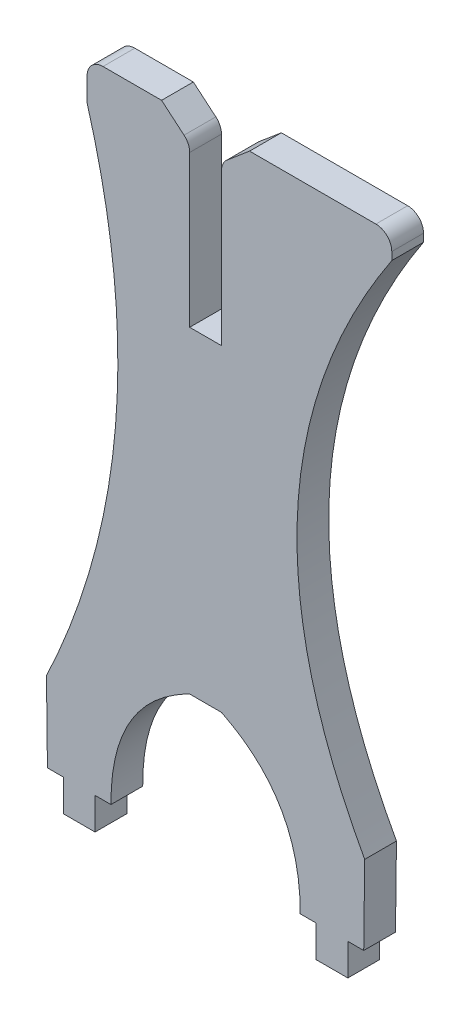
ISO-10303-21;
HEADER;
FILE_DESCRIPTION(('STEP AP214'),'2;1');
FILE_NAME('part.step','',(''),(''),'','','');
FILE_SCHEMA(('AUTOMOTIVE_DESIGN { 1 0 10303 214 1 1 1 1 }'));
ENDSEC;
DATA;
#1=APPLICATION_CONTEXT('core data for automotive mechanical design processes');
#2=APPLICATION_PROTOCOL_DEFINITION('international standard','automotive_design',2000,#1);
#3=PRODUCT_CONTEXT('',#1,'mechanical');
#4=PRODUCT('Part','Part','',(#3));
#5=PRODUCT_RELATED_PRODUCT_CATEGORY('part','',(#4));
#6=PRODUCT_DEFINITION_FORMATION('','',#4);
#7=PRODUCT_DEFINITION_CONTEXT('part definition',#1,'design');
#8=PRODUCT_DEFINITION('design','',#6,#7);
#9=PRODUCT_DEFINITION_SHAPE('','',#8);
#10=(LENGTH_UNIT() NAMED_UNIT(*) SI_UNIT(.MILLI.,.METRE.));
#11=(NAMED_UNIT(*) PLANE_ANGLE_UNIT() SI_UNIT($,.RADIAN.));
#12=(NAMED_UNIT(*) SI_UNIT($,.STERADIAN.) SOLID_ANGLE_UNIT());
#13=UNCERTAINTY_MEASURE_WITH_UNIT(LENGTH_MEASURE(1.E-05),#10,'distance_accuracy_value','');
#14=(GEOMETRIC_REPRESENTATION_CONTEXT(3) GLOBAL_UNCERTAINTY_ASSIGNED_CONTEXT((#13)) GLOBAL_UNIT_ASSIGNED_CONTEXT((#10,
#11,#12)) REPRESENTATION_CONTEXT('',''));
#15=CARTESIAN_POINT('',(0.,0.,0.));
#16=DIRECTION('',(0.,0.,1.));
#17=DIRECTION('',(1.,0.,0.));
#18=AXIS2_PLACEMENT_3D('',#15,#16,#17);
#19=CARTESIAN_POINT('',(27.9830745326084,55.8629681276195,5.08));
#20=DIRECTION('',(0.,-1.,0.));
#21=DIRECTION('',(0.,0.,-1.));
#22=AXIS2_PLACEMENT_3D('',#19,#20,#21);
#23=PLANE('',#22);
#24=DIRECTION('',(-1.,0.,0.));
#25=VECTOR('',#24,1.);
#26=CARTESIAN_POINT('',(27.9830745326084,55.8629681276195,0.));
#27=LINE('',#26,#25);
#28=CARTESIAN_POINT('',(27.9830745326084,55.8629681276195,0.));
#29=VERTEX_POINT('',#28);
#30=CARTESIAN_POINT('',(22.9030745326083,55.8629681276195,0.));
#31=VERTEX_POINT('',#30);
#32=EDGE_CURVE('E263',#29,#31,#27,.T.);
#33=ORIENTED_EDGE('',*,*,#32,.T.);
#34=DIRECTION('',(0.,0.,-1.));
#35=VECTOR('',#34,1.);
#36=CARTESIAN_POINT('',(22.9030745326083,55.8629681276195,5.08));
#37=LINE('',#36,#35);
#38=CARTESIAN_POINT('',(22.9030745326083,55.8629681276195,5.08));
#39=VERTEX_POINT('',#38);
#40=EDGE_CURVE('E242',#39,#31,#37,.T.);
#41=ORIENTED_EDGE('',*,*,#40,.F.);
#42=DIRECTION('',(-1.,0.,0.));
#43=VECTOR('',#42,1.);
#44=CARTESIAN_POINT('',(27.9830745326084,55.8629681276195,5.08));
#45=LINE('',#44,#43);
#46=CARTESIAN_POINT('',(27.9830745326084,55.8629681276195,5.08));
#47=VERTEX_POINT('',#46);
#48=EDGE_CURVE('E250',#47,#39,#45,.T.);
#49=ORIENTED_EDGE('',*,*,#48,.F.);
#50=DIRECTION('',(0.,0.,-1.));
#51=VECTOR('',#50,1.);
#52=CARTESIAN_POINT('',(27.9830745326084,55.8629681276195,5.08));
#53=LINE('',#52,#51);
#54=EDGE_CURVE('E343',#47,#29,#53,.T.);
#55=ORIENTED_EDGE('',*,*,#54,.T.);
#56=EDGE_LOOP('',(#33,#41,#49,#55));
#57=FACE_BOUND('',#56,.T.);
#58=ADVANCED_FACE('F39',(#57),#23,.F.);
#59=CARTESIAN_POINT('',(22.9030745326083,55.8629681276195,5.08));
#60=DIRECTION('',(-1.,0.,0.));
#61=DIRECTION('',(0.,0.,1.));
#62=AXIS2_PLACEMENT_3D('',#59,#60,#61);
#63=PLANE('',#62);
#64=DIRECTION('',(0.,1.,0.));
#65=VECTOR('',#64,1.);
#66=CARTESIAN_POINT('',(22.9030745326083,55.8629681276195,0.));
#67=LINE('',#66,#65);
#68=CARTESIAN_POINT('',(22.9030745326083,80.082750059401,0.));
#69=VERTEX_POINT('',#68);
#70=EDGE_CURVE('E534',#31,#69,#67,.T.);
#71=ORIENTED_EDGE('',*,*,#70,.T.);
#72=DIRECTION('',(0.,0.,-1.));
#73=VECTOR('',#72,1.);
#74=CARTESIAN_POINT('',(22.9030745326083,80.082750059401,5.08));
#75=LINE('',#74,#73);
#76=CARTESIAN_POINT('',(22.9030745326083,80.082750059401,5.08));
#77=VERTEX_POINT('',#76);
#78=EDGE_CURVE('E245',#69,#77,#75,.F.);
#79=ORIENTED_EDGE('',*,*,#78,.T.);
#80=DIRECTION('',(0.,1.,0.));
#81=VECTOR('',#80,1.);
#82=CARTESIAN_POINT('',(22.9030745326083,55.8629681276195,5.08));
#83=LINE('',#82,#81);
#84=EDGE_CURVE('E237',#39,#77,#83,.T.);
#85=ORIENTED_EDGE('',*,*,#84,.F.);
#86=ORIENTED_EDGE('',*,*,#40,.T.);
#87=EDGE_LOOP('',(#71,#79,#85,#86));
#88=FACE_BOUND('',#87,.T.);
#89=ADVANCED_FACE('F240',(#88),#63,.F.);
#90=CARTESIAN_POINT('',(22.9030745326083,81.2629681276195,5.08));
#91=DIRECTION('',(-0.644869123495257,-0.76429301551333,0.));
#92=DIRECTION('',(0.76429301551333,-0.644869123495257,0.));
#93=AXIS2_PLACEMENT_3D('',#90,#91,#92);
#94=PLANE('',#93);
#95=DIRECTION('',(-0.76429301551333,0.644869123495257,0.));
#96=VECTOR('',#95,1.);
#97=CARTESIAN_POINT('',(22.9030745326083,81.2629681276195,5.08));
#98=LINE('',#97,#96);
#99=CARTESIAN_POINT('',(22.0010421062863,82.0240543188048,5.08));
#100=VERTEX_POINT('',#99);
#101=CARTESIAN_POINT('',(18.4064304245404,85.0569933061595,5.08));
#102=VERTEX_POINT('',#101);
#103=EDGE_CURVE('E249',#100,#102,#98,.T.);
#104=ORIENTED_EDGE('',*,*,#103,.F.);
#105=DIRECTION('',(0.,0.,-1.));
#106=VECTOR('',#105,1.);
#107=CARTESIAN_POINT('',(22.0010421062863,82.0240543188048,5.08));
#108=LINE('',#107,#106);
#109=CARTESIAN_POINT('',(22.0010421062863,82.0240543188048,0.));
#110=VERTEX_POINT('',#109);
#111=EDGE_CURVE('E265',#100,#110,#108,.T.);
#112=ORIENTED_EDGE('',*,*,#111,.T.);
#113=DIRECTION('',(-0.76429301551333,0.644869123495257,0.));
#114=VECTOR('',#113,1.);
#115=CARTESIAN_POINT('',(22.9030745326083,81.2629681276195,0.));
#116=LINE('',#115,#114);
#117=CARTESIAN_POINT('',(18.4064304245404,85.0569933061595,0.));
#118=VERTEX_POINT('',#117);
#119=EDGE_CURVE('E537',#110,#118,#116,.T.);
#120=ORIENTED_EDGE('',*,*,#119,.T.);
#121=DIRECTION('',(0.,0.,-1.));
#122=VECTOR('',#121,1.);
#123=CARTESIAN_POINT('',(18.4064304245404,85.0569933061595,5.08));
#124=LINE('',#123,#122);
#125=EDGE_CURVE('E266',#102,#118,#124,.T.);
#126=ORIENTED_EDGE('',*,*,#125,.F.);
#127=EDGE_LOOP('',(#104,#112,#120,#126));
#128=FACE_BOUND('',#127,.T.);
#129=ADVANCED_FACE('F582',(#128),#94,.F.);
#130=CARTESIAN_POINT('',(6.50018042454045,85.0569933061595,5.08));
#131=DIRECTION('',(0.,-1.,0.));
#132=DIRECTION('',(0.,0.,-1.));
#133=AXIS2_PLACEMENT_3D('',#130,#131,#132);
#134=PLANE('',#133);
#135=DIRECTION('',(-1.,0.,0.));
#136=VECTOR('',#135,1.);
#137=CARTESIAN_POINT('',(6.50018042454045,85.0569933061595,0.));
#138=LINE('',#137,#136);
#139=CARTESIAN_POINT('',(9.04018042454045,85.0569933061595,0.));
#140=VERTEX_POINT('',#139);
#141=EDGE_CURVE('E439',#118,#140,#138,.T.);
#142=ORIENTED_EDGE('',*,*,#141,.T.);
#143=DIRECTION('',(0.,0.,-1.));
#144=VECTOR('',#143,1.);
#145=CARTESIAN_POINT('',(9.04018042454045,85.0569933061595,5.08));
#146=LINE('',#145,#144);
#147=CARTESIAN_POINT('',(9.04018042454045,85.0569933061595,5.08));
#148=VERTEX_POINT('',#147);
#149=EDGE_CURVE('E305',#140,#148,#146,.F.);
#150=ORIENTED_EDGE('',*,*,#149,.T.);
#151=DIRECTION('',(-1.,0.,0.));
#152=VECTOR('',#151,1.);
#153=CARTESIAN_POINT('',(6.50018042454045,85.0569933061595,5.08));
#154=LINE('',#153,#152);
#155=EDGE_CURVE('E554',#102,#148,#154,.T.);
#156=ORIENTED_EDGE('',*,*,#155,.F.);
#157=ORIENTED_EDGE('',*,*,#125,.T.);
#158=EDGE_LOOP('',(#142,#150,#156,#157));
#159=FACE_BOUND('',#158,.T.);
#160=ADVANCED_FACE('F544',(#159),#134,.F.);
#161=CARTESIAN_POINT('',(6.50018042454045,85.0569933061595,5.08));
#162=DIRECTION('',(1.,0.,0.));
#163=DIRECTION('',(0.,1.,0.));
#164=AXIS2_PLACEMENT_3D('',#161,#162,#163);
#165=PLANE('',#164);
#166=DIRECTION('',(0.,-1.,0.));
#167=VECTOR('',#166,1.);
#168=CARTESIAN_POINT('',(6.50018042454045,85.0569933061595,5.08));
#169=LINE('',#168,#167);
#170=CARTESIAN_POINT('',(6.50018042454045,82.5169933061595,5.08));
#171=VERTEX_POINT('',#170);
#172=CARTESIAN_POINT('',(6.50018042454045,78.7069933061595,5.08));
#173=VERTEX_POINT('',#172);
#174=EDGE_CURVE('E553',#171,#173,#169,.T.);
#175=ORIENTED_EDGE('',*,*,#174,.F.);
#176=DIRECTION('',(0.,0.,-1.));
#177=VECTOR('',#176,1.);
#178=CARTESIAN_POINT('',(6.50018042454045,82.5169933061595,5.08));
#179=LINE('',#178,#177);
#180=CARTESIAN_POINT('',(6.50018042454045,82.5169933061595,0.));
#181=VERTEX_POINT('',#180);
#182=EDGE_CURVE('E298',#171,#181,#179,.T.);
#183=ORIENTED_EDGE('',*,*,#182,.T.);
#184=DIRECTION('',(0.,-1.,0.));
#185=VECTOR('',#184,1.);
#186=CARTESIAN_POINT('',(6.50018042454045,85.0569933061595,0.));
#187=LINE('',#186,#185);
#188=CARTESIAN_POINT('',(6.50018042454045,78.7069933061595,0.));
#189=VERTEX_POINT('',#188);
#190=EDGE_CURVE('E430',#181,#189,#187,.T.);
#191=ORIENTED_EDGE('',*,*,#190,.T.);
#192=DIRECTION('',(0.,0.,-1.));
#193=VECTOR('',#192,1.);
#194=CARTESIAN_POINT('',(6.50018042454045,78.7069933061595,5.08));
#195=LINE('',#194,#193);
#196=EDGE_CURVE('E274',#173,#189,#195,.T.);
#197=ORIENTED_EDGE('',*,*,#196,.F.);
#198=EDGE_LOOP('',(#175,#183,#191,#197));
#199=FACE_BOUND('',#198,.T.);
#200=ADVANCED_FACE('F555',(#199),#165,.F.);
#201=CARTESIAN_POINT('',(6.50018042454045,78.7069933061595,5.08));
#202=CARTESIAN_POINT('',(18.9018082071928,35.9899355292535,5.08));
#203=CARTESIAN_POINT('',(-0.00588856136727721,-3.84394326152831,5.08));
#204=B_SPLINE_CURVE_WITH_KNOTS('',2,(#201,#202,#203),.UNSPECIFIED.,.F.,.F.,(3,3),(0.,1.),.UNSPECIFIED.);
#205=DIRECTION('',(0.,0.,-1.));
#206=VECTOR('',#205,1.);
#207=SURFACE_OF_LINEAR_EXTRUSION('',#204,#206);
#208=CARTESIAN_POINT('',(6.50018042454045,78.7069933061595,0.));
#209=CARTESIAN_POINT('',(18.9018082071928,35.9899355292535,0.));
#210=CARTESIAN_POINT('',(-0.00588856136727721,-3.84394326152831,0.));
#211=B_SPLINE_CURVE_WITH_KNOTS('',2,(#208,#209,#210),.UNSPECIFIED.,.F.,.F.,(3,3),(0.,1.),.UNSPECIFIED.);
#212=CARTESIAN_POINT('',(-0.00588856136727721,-3.84394326152831,0.));
#213=VERTEX_POINT('',#212);
#214=EDGE_CURVE('E424',#189,#213,#211,.T.);
#215=ORIENTED_EDGE('',*,*,#214,.T.);
#216=DIRECTION('',(0.,0.,-1.));
#217=VECTOR('',#216,1.);
#218=CARTESIAN_POINT('',(-0.00588856136727721,-3.84394326152831,5.08));
#219=LINE('',#218,#217);
#220=CARTESIAN_POINT('',(-0.00588856136727721,-3.84394326152831,5.08));
#221=VERTEX_POINT('',#220);
#222=EDGE_CURVE('E413',#221,#213,#219,.T.);
#223=ORIENTED_EDGE('',*,*,#222,.F.);
#224=EDGE_CURVE('E425',#173,#221,#204,.T.);
#225=ORIENTED_EDGE('',*,*,#224,.F.);
#226=ORIENTED_EDGE('',*,*,#196,.T.);
#227=EDGE_LOOP('',(#215,#223,#225,#226));
#228=FACE_BOUND('',#227,.T.);
#229=ADVANCED_FACE('F422',(#228),#207,.F.);
#230=CARTESIAN_POINT('',(0.148344840043882,-16.5430066938405,5.08));
#231=DIRECTION('',(0.999926254512772,0.0121443623158393,0.));
#232=DIRECTION('',(-0.0121443623158393,0.999926254512772,0.));
#233=AXIS2_PLACEMENT_3D('',#230,#231,#232);
#234=PLANE('',#233);
#235=DIRECTION('',(0.0121443623158393,-0.999926254512772,0.));
#236=VECTOR('',#235,1.);
#237=CARTESIAN_POINT('',(0.148344840043882,-16.5430066938405,0.));
#238=LINE('',#237,#236);
#239=CARTESIAN_POINT('',(0.148344840043882,-16.5430066938405,0.));
#240=VERTEX_POINT('',#239);
#241=EDGE_CURVE('E432',#213,#240,#238,.T.);
#242=ORIENTED_EDGE('',*,*,#241,.T.);
#243=DIRECTION('',(0.,0.,-1.));
#244=VECTOR('',#243,1.);
#245=CARTESIAN_POINT('',(0.148344840043882,-16.5430066938405,5.08));
#246=LINE('',#245,#244);
#247=CARTESIAN_POINT('',(0.148344840043882,-16.5430066938405,5.08));
#248=VERTEX_POINT('',#247);
#249=EDGE_CURVE('E409',#248,#240,#246,.T.);
#250=ORIENTED_EDGE('',*,*,#249,.F.);
#251=DIRECTION('',(0.0121443623158393,-0.999926254512772,0.));
#252=VECTOR('',#251,1.);
#253=CARTESIAN_POINT('',(0.148344840043882,-16.5430066938405,5.08));
#254=LINE('',#253,#252);
#255=EDGE_CURVE('E560',#221,#248,#254,.T.);
#256=ORIENTED_EDGE('',*,*,#255,.F.);
#257=ORIENTED_EDGE('',*,*,#222,.T.);
#258=EDGE_LOOP('',(#242,#250,#256,#257));
#259=FACE_BOUND('',#258,.T.);
#260=ADVANCED_FACE('F576',(#259),#234,.F.);
#261=CARTESIAN_POINT('',(0.148344840043882,-16.5430066938405,5.08));
#262=DIRECTION('',(0.,1.,0.));
#263=DIRECTION('',(0.,0.,1.));
#264=AXIS2_PLACEMENT_3D('',#261,#262,#263);
#265=PLANE('',#264);
#266=DIRECTION('',(1.,0.,0.));
#267=VECTOR('',#266,1.);
#268=CARTESIAN_POINT('',(0.148344840043882,-16.5430066938405,0.));
#269=LINE('',#268,#267);
#270=CARTESIAN_POINT('',(2.68834484004388,-16.5430066938405,0.));
#271=VERTEX_POINT('',#270);
#272=EDGE_CURVE('E437',#240,#271,#269,.T.);
#273=ORIENTED_EDGE('',*,*,#272,.T.);
#274=DIRECTION('',(0.,0.,-1.));
#275=VECTOR('',#274,1.);
#276=CARTESIAN_POINT('',(2.68834484004388,-16.5430066938405,5.08));
#277=LINE('',#276,#275);
#278=CARTESIAN_POINT('',(2.68834484004388,-16.5430066938405,5.08));
#279=VERTEX_POINT('',#278);
#280=EDGE_CURVE('E405',#279,#271,#277,.T.);
#281=ORIENTED_EDGE('',*,*,#280,.F.);
#282=DIRECTION('',(1.,0.,0.));
#283=VECTOR('',#282,1.);
#284=CARTESIAN_POINT('',(0.148344840043882,-16.5430066938405,5.08));
#285=LINE('',#284,#283);
#286=EDGE_CURVE('E747',#248,#279,#285,.T.);
#287=ORIENTED_EDGE('',*,*,#286,.F.);
#288=ORIENTED_EDGE('',*,*,#249,.T.);
#289=EDGE_LOOP('',(#273,#281,#287,#288));
#290=FACE_BOUND('',#289,.T.);
#291=ADVANCED_FACE('F744',(#290),#265,.F.);
#292=CARTESIAN_POINT('',(2.68834484004388,-16.5430066938405,5.08));
#293=DIRECTION('',(1.,0.,0.));
#294=DIRECTION('',(0.,1.,0.));
#295=AXIS2_PLACEMENT_3D('',#292,#293,#294);
#296=PLANE('',#295);
#297=DIRECTION('',(0.,-1.,0.));
#298=VECTOR('',#297,1.);
#299=CARTESIAN_POINT('',(2.68834484004388,-16.5430066938405,0.));
#300=LINE('',#299,#298);
#301=CARTESIAN_POINT('',(2.68834484004388,-21.6230066938405,0.));
#302=VERTEX_POINT('',#301);
#303=EDGE_CURVE('E450',#271,#302,#300,.T.);
#304=ORIENTED_EDGE('',*,*,#303,.T.);
#305=DIRECTION('',(0.,0.,-1.));
#306=VECTOR('',#305,1.);
#307=CARTESIAN_POINT('',(2.68834484004388,-21.6230066938405,5.08));
#308=LINE('',#307,#306);
#309=CARTESIAN_POINT('',(2.68834484004388,-21.6230066938405,5.08));
#310=VERTEX_POINT('',#309);
#311=EDGE_CURVE('E401',#310,#302,#308,.T.);
#312=ORIENTED_EDGE('',*,*,#311,.F.);
#313=DIRECTION('',(0.,-1.,0.));
#314=VECTOR('',#313,1.);
#315=CARTESIAN_POINT('',(2.68834484004388,-16.5430066938405,5.08));
#316=LINE('',#315,#314);
#317=EDGE_CURVE('E741',#279,#310,#316,.T.);
#318=ORIENTED_EDGE('',*,*,#317,.F.);
#319=ORIENTED_EDGE('',*,*,#280,.T.);
#320=EDGE_LOOP('',(#304,#312,#318,#319));
#321=FACE_BOUND('',#320,.T.);
#322=ADVANCED_FACE('F740',(#321),#296,.F.);
#323=CARTESIAN_POINT('',(2.68834484004388,-21.6230066938405,5.08));
#324=DIRECTION('',(0.,1.,0.));
#325=DIRECTION('',(0.,0.,1.));
#326=AXIS2_PLACEMENT_3D('',#323,#324,#325);
#327=PLANE('',#326);
#328=DIRECTION('',(1.,0.,0.));
#329=VECTOR('',#328,1.);
#330=CARTESIAN_POINT('',(2.68834484004388,-21.6230066938405,0.));
#331=LINE('',#330,#329);
#332=CARTESIAN_POINT('',(7.76834484004388,-21.6230066938405,0.));
#333=VERTEX_POINT('',#332);
#334=EDGE_CURVE('E453',#302,#333,#331,.T.);
#335=ORIENTED_EDGE('',*,*,#334,.T.);
#336=DIRECTION('',(0.,0.,-1.));
#337=VECTOR('',#336,1.);
#338=CARTESIAN_POINT('',(7.76834484004388,-21.6230066938405,5.08));
#339=LINE('',#338,#337);
#340=CARTESIAN_POINT('',(7.76834484004388,-21.6230066938405,5.08));
#341=VERTEX_POINT('',#340);
#342=EDGE_CURVE('E397',#341,#333,#339,.T.);
#343=ORIENTED_EDGE('',*,*,#342,.F.);
#344=DIRECTION('',(1.,0.,0.));
#345=VECTOR('',#344,1.);
#346=CARTESIAN_POINT('',(2.68834484004388,-21.6230066938405,5.08));
#347=LINE('',#346,#345);
#348=EDGE_CURVE('E736',#310,#341,#347,.T.);
#349=ORIENTED_EDGE('',*,*,#348,.F.);
#350=ORIENTED_EDGE('',*,*,#311,.T.);
#351=EDGE_LOOP('',(#335,#343,#349,#350));
#352=FACE_BOUND('',#351,.T.);
#353=ADVANCED_FACE('F735',(#352),#327,.F.);
#354=CARTESIAN_POINT('',(7.76834484004389,-16.5430066938405,5.08));
#355=DIRECTION('',(-1.,0.,0.));
#356=DIRECTION('',(0.,-1.,0.));
#357=AXIS2_PLACEMENT_3D('',#354,#355,#356);
#358=PLANE('',#357);
#359=DIRECTION('',(0.,1.,0.));
#360=VECTOR('',#359,1.);
#361=CARTESIAN_POINT('',(7.76834484004389,-16.5430066938405,0.));
#362=LINE('',#361,#360);
#363=CARTESIAN_POINT('',(7.76834484004389,-16.5430066938405,0.));
#364=VERTEX_POINT('',#363);
#365=EDGE_CURVE('E456',#333,#364,#362,.T.);
#366=ORIENTED_EDGE('',*,*,#365,.T.);
#367=DIRECTION('',(0.,0.,-1.));
#368=VECTOR('',#367,1.);
#369=CARTESIAN_POINT('',(7.76834484004389,-16.5430066938405,5.08));
#370=LINE('',#369,#368);
#371=CARTESIAN_POINT('',(7.76834484004389,-16.5430066938405,5.08));
#372=VERTEX_POINT('',#371);
#373=EDGE_CURVE('E393',#372,#364,#370,.T.);
#374=ORIENTED_EDGE('',*,*,#373,.F.);
#375=DIRECTION('',(0.,1.,0.));
#376=VECTOR('',#375,1.);
#377=CARTESIAN_POINT('',(7.76834484004389,-16.5430066938405,5.08));
#378=LINE('',#377,#376);
#379=EDGE_CURVE('E732',#341,#372,#378,.T.);
#380=ORIENTED_EDGE('',*,*,#379,.F.);
#381=ORIENTED_EDGE('',*,*,#342,.T.);
#382=EDGE_LOOP('',(#366,#374,#380,#381));
#383=FACE_BOUND('',#382,.T.);
#384=ADVANCED_FACE('F729',(#383),#358,.F.);
#385=CARTESIAN_POINT('',(7.76834484004389,-16.5430066938405,5.08));
#386=DIRECTION('',(0.,1.,0.));
#387=DIRECTION('',(0.,0.,1.));
#388=AXIS2_PLACEMENT_3D('',#385,#386,#387);
#389=PLANE('',#388);
#390=DIRECTION('',(1.,0.,0.));
#391=VECTOR('',#390,1.);
#392=CARTESIAN_POINT('',(7.76834484004389,-16.5430066938405,0.));
#393=LINE('',#392,#391);
#394=CARTESIAN_POINT('',(10.3083448400439,-16.5430066938405,0.));
#395=VERTEX_POINT('',#394);
#396=EDGE_CURVE('E459',#364,#395,#393,.T.);
#397=ORIENTED_EDGE('',*,*,#396,.T.);
#398=DIRECTION('',(0.,0.,-1.));
#399=VECTOR('',#398,1.);
#400=CARTESIAN_POINT('',(10.3083448400439,-16.5430066938405,5.08));
#401=LINE('',#400,#399);
#402=CARTESIAN_POINT('',(10.3083448400439,-16.5430066938405,5.08));
#403=VERTEX_POINT('',#402);
#404=EDGE_CURVE('E389',#403,#395,#401,.T.);
#405=ORIENTED_EDGE('',*,*,#404,.F.);
#406=DIRECTION('',(1.,0.,0.));
#407=VECTOR('',#406,1.);
#408=CARTESIAN_POINT('',(7.76834484004389,-16.5430066938405,5.08));
#409=LINE('',#408,#407);
#410=EDGE_CURVE('E723',#372,#403,#409,.T.);
#411=ORIENTED_EDGE('',*,*,#410,.F.);
#412=ORIENTED_EDGE('',*,*,#373,.T.);
#413=EDGE_LOOP('',(#397,#405,#411,#412));
#414=FACE_BOUND('',#413,.T.);
#415=ADVANCED_FACE('F722',(#414),#389,.F.);
#416=CARTESIAN_POINT('',(10.3083448400439,-16.5430066938405,5.08));
#417=CARTESIAN_POINT('',(10.2023300009113,-1.22119794048092,5.08));
#418=CARTESIAN_POINT('',(22.9030745326083,5.06296812761946,5.08));
#419=B_SPLINE_CURVE_WITH_KNOTS('',2,(#416,#417,#418),.UNSPECIFIED.,.F.,.F.,(3,3),(0.,1.),.UNSPECIFIED.);
#420=DIRECTION('',(0.,0.,-1.));
#421=VECTOR('',#420,1.);
#422=SURFACE_OF_LINEAR_EXTRUSION('',#419,#421);
#423=CARTESIAN_POINT('',(10.3083448400439,-16.5430066938405,0.));
#424=CARTESIAN_POINT('',(10.2023300009113,-1.22119794048092,0.));
#425=CARTESIAN_POINT('',(22.9030745326083,5.06296812761946,0.));
#426=B_SPLINE_CURVE_WITH_KNOTS('',2,(#423,#424,#425),.UNSPECIFIED.,.F.,.F.,(3,3),(0.,1.),.UNSPECIFIED.);
#427=CARTESIAN_POINT('',(22.9030745326083,5.06296812761946,0.));
#428=VERTEX_POINT('',#427);
#429=EDGE_CURVE('E462',#395,#428,#426,.T.);
#430=ORIENTED_EDGE('',*,*,#429,.T.);
#431=DIRECTION('',(0.,0.,-1.));
#432=VECTOR('',#431,1.);
#433=CARTESIAN_POINT('',(22.9030745326083,5.06296812761946,5.08));
#434=LINE('',#433,#432);
#435=CARTESIAN_POINT('',(22.9030745326083,5.06296812761946,5.08));
#436=VERTEX_POINT('',#435);
#437=EDGE_CURVE('E385',#436,#428,#434,.T.);
#438=ORIENTED_EDGE('',*,*,#437,.F.);
#439=EDGE_CURVE('E718',#403,#436,#419,.T.);
#440=ORIENTED_EDGE('',*,*,#439,.F.);
#441=ORIENTED_EDGE('',*,*,#404,.T.);
#442=EDGE_LOOP('',(#430,#438,#440,#441));
#443=FACE_BOUND('',#442,.T.);
#444=ADVANCED_FACE('F717',(#443),#422,.F.);
#445=CARTESIAN_POINT('',(27.9830745326083,5.06296812761946,5.08));
#446=DIRECTION('',(0.,1.,0.));
#447=DIRECTION('',(0.,0.,1.));
#448=AXIS2_PLACEMENT_3D('',#445,#446,#447);
#449=PLANE('',#448);
#450=DIRECTION('',(1.,0.,0.));
#451=VECTOR('',#450,1.);
#452=CARTESIAN_POINT('',(27.9830745326083,5.06296812761946,0.));
#453=LINE('',#452,#451);
#454=CARTESIAN_POINT('',(27.9830745326083,5.06296812761946,0.));
#455=VERTEX_POINT('',#454);
#456=EDGE_CURVE('E467',#428,#455,#453,.T.);
#457=ORIENTED_EDGE('',*,*,#456,.T.);
#458=DIRECTION('',(0.,0.,-1.));
#459=VECTOR('',#458,1.);
#460=CARTESIAN_POINT('',(27.9830745326083,5.06296812761946,5.08));
#461=LINE('',#460,#459);
#462=CARTESIAN_POINT('',(27.9830745326083,5.06296812761946,5.08));
#463=VERTEX_POINT('',#462);
#464=EDGE_CURVE('E381',#463,#455,#461,.T.);
#465=ORIENTED_EDGE('',*,*,#464,.F.);
#466=DIRECTION('',(1.,0.,0.));
#467=VECTOR('',#466,1.);
#468=CARTESIAN_POINT('',(27.9830745326083,5.06296812761946,5.08));
#469=LINE('',#468,#467);
#470=EDGE_CURVE('E670',#436,#463,#469,.T.);
#471=ORIENTED_EDGE('',*,*,#470,.F.);
#472=ORIENTED_EDGE('',*,*,#437,.T.);
#473=EDGE_LOOP('',(#457,#465,#471,#472));
#474=FACE_BOUND('',#473,.T.);
#475=ADVANCED_FACE('F659',(#474),#449,.F.);
#476=CARTESIAN_POINT('',(27.9830745326083,5.06296812761946,5.08));
#477=CARTESIAN_POINT('',(40.6838190643054,-1.22119794048091,5.08));
#478=CARTESIAN_POINT('',(40.5778042251728,-16.5430066938405,5.08));
#479=B_SPLINE_CURVE_WITH_KNOTS('',2,(#476,#477,#478),.UNSPECIFIED.,.F.,.F.,(3,3),(0.,1.),.UNSPECIFIED.);
#480=DIRECTION('',(0.,0.,-1.));
#481=VECTOR('',#480,1.);
#482=SURFACE_OF_LINEAR_EXTRUSION('',#479,#481);
#483=CARTESIAN_POINT('',(27.9830745326083,5.06296812761946,0.));
#484=CARTESIAN_POINT('',(40.6838190643054,-1.22119794048091,0.));
#485=CARTESIAN_POINT('',(40.5778042251728,-16.5430066938405,0.));
#486=B_SPLINE_CURVE_WITH_KNOTS('',2,(#483,#484,#485),.UNSPECIFIED.,.F.,.F.,(3,3),(0.,1.),.UNSPECIFIED.);
#487=CARTESIAN_POINT('',(40.5778042251728,-16.5430066938405,0.));
#488=VERTEX_POINT('',#487);
#489=EDGE_CURVE('E473',#455,#488,#486,.T.);
#490=ORIENTED_EDGE('',*,*,#489,.T.);
#491=DIRECTION('',(0.,0.,-1.));
#492=VECTOR('',#491,1.);
#493=CARTESIAN_POINT('',(40.5778042251728,-16.5430066938405,5.08));
#494=LINE('',#493,#492);
#495=CARTESIAN_POINT('',(40.5778042251728,-16.5430066938405,5.08));
#496=VERTEX_POINT('',#495);
#497=EDGE_CURVE('E377',#496,#488,#494,.T.);
#498=ORIENTED_EDGE('',*,*,#497,.F.);
#499=EDGE_CURVE('E662',#463,#496,#479,.T.);
#500=ORIENTED_EDGE('',*,*,#499,.F.);
#501=ORIENTED_EDGE('',*,*,#464,.T.);
#502=EDGE_LOOP('',(#490,#498,#500,#501));
#503=FACE_BOUND('',#502,.T.);
#504=ADVANCED_FACE('F654',(#503),#482,.F.);
#505=CARTESIAN_POINT('',(43.1178042251728,-16.5430066938405,5.08));
#506=DIRECTION('',(0.,1.,0.));
#507=DIRECTION('',(0.,0.,1.));
#508=AXIS2_PLACEMENT_3D('',#505,#506,#507);
#509=PLANE('',#508);
#510=DIRECTION('',(1.,0.,0.));
#511=VECTOR('',#510,1.);
#512=CARTESIAN_POINT('',(43.1178042251728,-16.5430066938405,0.));
#513=LINE('',#512,#511);
#514=CARTESIAN_POINT('',(43.1178042251728,-16.5430066938405,0.));
#515=VERTEX_POINT('',#514);
#516=EDGE_CURVE('E478',#488,#515,#513,.T.);
#517=ORIENTED_EDGE('',*,*,#516,.T.);
#518=DIRECTION('',(0.,0.,-1.));
#519=VECTOR('',#518,1.);
#520=CARTESIAN_POINT('',(43.1178042251728,-16.5430066938405,5.08));
#521=LINE('',#520,#519);
#522=CARTESIAN_POINT('',(43.1178042251728,-16.5430066938405,5.08));
#523=VERTEX_POINT('',#522);
#524=EDGE_CURVE('E373',#523,#515,#521,.T.);
#525=ORIENTED_EDGE('',*,*,#524,.F.);
#526=DIRECTION('',(1.,0.,0.));
#527=VECTOR('',#526,1.);
#528=CARTESIAN_POINT('',(43.1178042251728,-16.5430066938405,5.08));
#529=LINE('',#528,#527);
#530=EDGE_CURVE('E669',#496,#523,#529,.T.);
#531=ORIENTED_EDGE('',*,*,#530,.F.);
#532=ORIENTED_EDGE('',*,*,#497,.T.);
#533=EDGE_LOOP('',(#517,#525,#531,#532));
#534=FACE_BOUND('',#533,.T.);
#535=ADVANCED_FACE('F650',(#534),#509,.F.);
#536=CARTESIAN_POINT('',(43.1178042251728,-16.5430066938405,5.08));
#537=DIRECTION('',(1.,0.,0.));
#538=DIRECTION('',(0.,1.,0.));
#539=AXIS2_PLACEMENT_3D('',#536,#537,#538);
#540=PLANE('',#539);
#541=DIRECTION('',(0.,-1.,0.));
#542=VECTOR('',#541,1.);
#543=CARTESIAN_POINT('',(43.1178042251728,-16.5430066938405,0.));
#544=LINE('',#543,#542);
#545=CARTESIAN_POINT('',(43.1178042251728,-21.6230066938405,0.));
#546=VERTEX_POINT('',#545);
#547=EDGE_CURVE('E484',#515,#546,#544,.T.);
#548=ORIENTED_EDGE('',*,*,#547,.T.);
#549=DIRECTION('',(0.,0.,-1.));
#550=VECTOR('',#549,1.);
#551=CARTESIAN_POINT('',(43.1178042251728,-21.6230066938405,5.08));
#552=LINE('',#551,#550);
#553=CARTESIAN_POINT('',(43.1178042251728,-21.6230066938405,5.08));
#554=VERTEX_POINT('',#553);
#555=EDGE_CURVE('E369',#554,#546,#552,.T.);
#556=ORIENTED_EDGE('',*,*,#555,.F.);
#557=DIRECTION('',(0.,-1.,0.));
#558=VECTOR('',#557,1.);
#559=CARTESIAN_POINT('',(43.1178042251728,-16.5430066938405,5.08));
#560=LINE('',#559,#558);
#561=EDGE_CURVE('E677',#523,#554,#560,.T.);
#562=ORIENTED_EDGE('',*,*,#561,.F.);
#563=ORIENTED_EDGE('',*,*,#524,.T.);
#564=EDGE_LOOP('',(#548,#556,#562,#563));
#565=FACE_BOUND('',#564,.T.);
#566=ADVANCED_FACE('F646',(#565),#540,.F.);
#567=CARTESIAN_POINT('',(48.1978042251728,-21.6230066938405,5.08));
#568=DIRECTION('',(0.,1.,0.));
#569=DIRECTION('',(0.,0.,1.));
#570=AXIS2_PLACEMENT_3D('',#567,#568,#569);
#571=PLANE('',#570);
#572=DIRECTION('',(1.,0.,0.));
#573=VECTOR('',#572,1.);
#574=CARTESIAN_POINT('',(48.1978042251728,-21.6230066938405,0.));
#575=LINE('',#574,#573);
#576=CARTESIAN_POINT('',(48.1978042251728,-21.6230066938405,0.));
#577=VERTEX_POINT('',#576);
#578=EDGE_CURVE('E487',#546,#577,#575,.T.);
#579=ORIENTED_EDGE('',*,*,#578,.T.);
#580=DIRECTION('',(0.,0.,-1.));
#581=VECTOR('',#580,1.);
#582=CARTESIAN_POINT('',(48.1978042251728,-21.6230066938405,5.08));
#583=LINE('',#582,#581);
#584=CARTESIAN_POINT('',(48.1978042251728,-21.6230066938405,5.08));
#585=VERTEX_POINT('',#584);
#586=EDGE_CURVE('E365',#585,#577,#583,.T.);
#587=ORIENTED_EDGE('',*,*,#586,.F.);
#588=DIRECTION('',(1.,0.,0.));
#589=VECTOR('',#588,1.);
#590=CARTESIAN_POINT('',(48.1978042251728,-21.6230066938405,5.08));
#591=LINE('',#590,#589);
#592=EDGE_CURVE('E680',#554,#585,#591,.T.);
#593=ORIENTED_EDGE('',*,*,#592,.F.);
#594=ORIENTED_EDGE('',*,*,#555,.T.);
#595=EDGE_LOOP('',(#579,#587,#593,#594));
#596=FACE_BOUND('',#595,.T.);
#597=ADVANCED_FACE('F642',(#596),#571,.F.);
#598=CARTESIAN_POINT('',(48.1978042251728,-16.5430066938405,5.08));
#599=DIRECTION('',(-1.,0.,0.));
#600=DIRECTION('',(0.,-1.,0.));
#601=AXIS2_PLACEMENT_3D('',#598,#599,#600);
#602=PLANE('',#601);
#603=DIRECTION('',(0.,1.,0.));
#604=VECTOR('',#603,1.);
#605=CARTESIAN_POINT('',(48.1978042251728,-16.5430066938405,0.));
#606=LINE('',#605,#604);
#607=CARTESIAN_POINT('',(48.1978042251728,-16.5430066938405,0.));
#608=VERTEX_POINT('',#607);
#609=EDGE_CURVE('E490',#577,#608,#606,.T.);
#610=ORIENTED_EDGE('',*,*,#609,.T.);
#611=DIRECTION('',(0.,0.,-1.));
#612=VECTOR('',#611,1.);
#613=CARTESIAN_POINT('',(48.1978042251728,-16.5430066938405,5.08));
#614=LINE('',#613,#612);
#615=CARTESIAN_POINT('',(48.1978042251728,-16.5430066938405,5.08));
#616=VERTEX_POINT('',#615);
#617=EDGE_CURVE('E361',#616,#608,#614,.T.);
#618=ORIENTED_EDGE('',*,*,#617,.F.);
#619=DIRECTION('',(0.,1.,0.));
#620=VECTOR('',#619,1.);
#621=CARTESIAN_POINT('',(48.1978042251728,-16.5430066938405,5.08));
#622=LINE('',#621,#620);
#623=EDGE_CURVE('E683',#585,#616,#622,.T.);
#624=ORIENTED_EDGE('',*,*,#623,.F.);
#625=ORIENTED_EDGE('',*,*,#586,.T.);
#626=EDGE_LOOP('',(#610,#618,#624,#625));
#627=FACE_BOUND('',#626,.T.);
#628=ADVANCED_FACE('F638',(#627),#602,.F.);
#629=CARTESIAN_POINT('',(50.7378042251728,-16.5430066938405,5.08));
#630=DIRECTION('',(0.,1.,0.));
#631=DIRECTION('',(0.,0.,1.));
#632=AXIS2_PLACEMENT_3D('',#629,#630,#631);
#633=PLANE('',#632);
#634=DIRECTION('',(1.,0.,0.));
#635=VECTOR('',#634,1.);
#636=CARTESIAN_POINT('',(50.7378042251728,-16.5430066938405,0.));
#637=LINE('',#636,#635);
#638=CARTESIAN_POINT('',(50.7378042251728,-16.5430066938405,0.));
#639=VERTEX_POINT('',#638);
#640=EDGE_CURVE('E493',#608,#639,#637,.T.);
#641=ORIENTED_EDGE('',*,*,#640,.T.);
#642=DIRECTION('',(0.,0.,-1.));
#643=VECTOR('',#642,1.);
#644=CARTESIAN_POINT('',(50.7378042251728,-16.5430066938405,5.08));
#645=LINE('',#644,#643);
#646=CARTESIAN_POINT('',(50.7378042251728,-16.5430066938405,5.08));
#647=VERTEX_POINT('',#646);
#648=EDGE_CURVE('E357',#647,#639,#645,.T.);
#649=ORIENTED_EDGE('',*,*,#648,.F.);
#650=DIRECTION('',(1.,0.,0.));
#651=VECTOR('',#650,1.);
#652=CARTESIAN_POINT('',(50.7378042251728,-16.5430066938405,5.08));
#653=LINE('',#652,#651);
#654=EDGE_CURVE('E686',#616,#647,#653,.T.);
#655=ORIENTED_EDGE('',*,*,#654,.F.);
#656=ORIENTED_EDGE('',*,*,#617,.T.);
#657=EDGE_LOOP('',(#641,#649,#655,#656));
#658=FACE_BOUND('',#657,.T.);
#659=ADVANCED_FACE('F634',(#658),#633,.F.);
#660=CARTESIAN_POINT('',(50.7378042251728,-16.5430066938405,5.08));
#661=DIRECTION('',(-0.999926254512772,0.0121443623158398,0.));
#662=DIRECTION('',(-0.0121443623158398,-0.999926254512773,0.));
#663=AXIS2_PLACEMENT_3D('',#660,#661,#662);
#664=PLANE('',#663);
#665=DIRECTION('',(0.0121443623158398,0.999926254512772,0.));
#666=VECTOR('',#665,1.);
#667=CARTESIAN_POINT('',(50.7378042251728,-16.5430066938405,0.));
#668=LINE('',#667,#666);
#669=CARTESIAN_POINT('',(50.892037626584,-3.84394326152831,0.));
#670=VERTEX_POINT('',#669);
#671=EDGE_CURVE('E496',#639,#670,#668,.T.);
#672=ORIENTED_EDGE('',*,*,#671,.T.);
#673=DIRECTION('',(0.,0.,-1.));
#674=VECTOR('',#673,1.);
#675=CARTESIAN_POINT('',(50.892037626584,-3.84394326152831,5.08));
#676=LINE('',#675,#674);
#677=CARTESIAN_POINT('',(50.892037626584,-3.84394326152831,5.08));
#678=VERTEX_POINT('',#677);
#679=EDGE_CURVE('E353',#678,#670,#676,.T.);
#680=ORIENTED_EDGE('',*,*,#679,.F.);
#681=DIRECTION('',(0.0121443623158398,0.999926254512772,0.));
#682=VECTOR('',#681,1.);
#683=CARTESIAN_POINT('',(50.7378042251728,-16.5430066938405,5.08));
#684=LINE('',#683,#682);
#685=EDGE_CURVE('E520',#647,#678,#684,.T.);
#686=ORIENTED_EDGE('',*,*,#685,.F.);
#687=ORIENTED_EDGE('',*,*,#648,.T.);
#688=EDGE_LOOP('',(#672,#680,#686,#687));
#689=FACE_BOUND('',#688,.T.);
#690=ADVANCED_FACE('F631',(#689),#664,.F.);
#691=CARTESIAN_POINT('',(50.892037626584,-3.84394326152831,5.08));
#692=CARTESIAN_POINT('',(27.2430017319934,39.0939808909516,5.08));
#693=CARTESIAN_POINT('',(55.2236363265533,81.2629681276195,5.08));
#694=B_SPLINE_CURVE_WITH_KNOTS('',2,(#691,#692,#693),.UNSPECIFIED.,.F.,.F.,(3,3),(0.,1.),.UNSPECIFIED.);
#695=DIRECTION('',(0.,0.,-1.));
#696=VECTOR('',#695,1.);
#697=SURFACE_OF_LINEAR_EXTRUSION('',#694,#696);
#698=CARTESIAN_POINT('',(50.892037626584,-3.84394326152831,0.));
#699=CARTESIAN_POINT('',(27.2430017319934,39.0939808909516,0.));
#700=CARTESIAN_POINT('',(55.2236363265533,81.2629681276195,0.));
#701=B_SPLINE_CURVE_WITH_KNOTS('',2,(#698,#699,#700),.UNSPECIFIED.,.F.,.F.,(3,3),(0.,1.),.UNSPECIFIED.);
#702=CARTESIAN_POINT('',(55.2236363265533,81.2629681276195,0.));
#703=VERTEX_POINT('',#702);
#704=EDGE_CURVE('E337',#670,#703,#701,.T.);
#705=ORIENTED_EDGE('',*,*,#704,.T.);
#706=DIRECTION('',(0.,0.,-1.));
#707=VECTOR('',#706,1.);
#708=CARTESIAN_POINT('',(55.2236363265533,81.2629681276195,5.08));
#709=LINE('',#708,#707);
#710=CARTESIAN_POINT('',(55.2236363265533,81.2629681276195,5.08));
#711=VERTEX_POINT('',#710);
#712=EDGE_CURVE('E349',#711,#703,#709,.T.);
#713=ORIENTED_EDGE('',*,*,#712,.F.);
#714=EDGE_CURVE('E514',#678,#711,#694,.T.);
#715=ORIENTED_EDGE('',*,*,#714,.F.);
#716=ORIENTED_EDGE('',*,*,#679,.T.);
#717=EDGE_LOOP('',(#705,#713,#715,#716));
#718=FACE_BOUND('',#717,.T.);
#719=ADVANCED_FACE('F507',(#718),#697,.F.);
#720=CARTESIAN_POINT('',(55.2236363265533,85.0569933061595,5.08));
#721=DIRECTION('',(-1.,0.,0.));
#722=DIRECTION('',(0.,0.,1.));
#723=AXIS2_PLACEMENT_3D('',#720,#721,#722);
#724=PLANE('',#723);
#725=DIRECTION('',(0.,1.,0.));
#726=VECTOR('',#725,1.);
#727=CARTESIAN_POINT('',(55.2236363265533,85.0569933061595,0.));
#728=LINE('',#727,#726);
#729=CARTESIAN_POINT('',(55.2236363265533,82.5169933061595,0.));
#730=VERTEX_POINT('',#729);
#731=EDGE_CURVE('E332',#703,#730,#728,.T.);
#732=ORIENTED_EDGE('',*,*,#731,.T.);
#733=DIRECTION('',(0.,0.,-1.));
#734=VECTOR('',#733,1.);
#735=CARTESIAN_POINT('',(55.2236363265533,82.5169933061595,5.08));
#736=LINE('',#735,#734);
#737=CARTESIAN_POINT('',(55.2236363265533,82.5169933061595,5.08));
#738=VERTEX_POINT('',#737);
#739=EDGE_CURVE('E48',#730,#738,#736,.F.);
#740=ORIENTED_EDGE('',*,*,#739,.T.);
#741=DIRECTION('',(0.,1.,0.));
#742=VECTOR('',#741,1.);
#743=CARTESIAN_POINT('',(55.2236363265533,85.0569933061595,5.08));
#744=LINE('',#743,#742);
#745=EDGE_CURVE('E512',#711,#738,#744,.T.);
#746=ORIENTED_EDGE('',*,*,#745,.F.);
#747=ORIENTED_EDGE('',*,*,#712,.T.);
#748=EDGE_LOOP('',(#732,#740,#746,#747));
#749=FACE_BOUND('',#748,.T.);
#750=ADVANCED_FACE('F511',(#749),#724,.F.);
#751=CARTESIAN_POINT('',(55.2236363265533,85.0569933061595,5.08));
#752=DIRECTION('',(0.,-1.,0.));
#753=DIRECTION('',(0.,0.,-1.));
#754=AXIS2_PLACEMENT_3D('',#751,#752,#753);
#755=PLANE('',#754);
#756=DIRECTION('',(-1.,0.,0.));
#757=VECTOR('',#756,1.);
#758=CARTESIAN_POINT('',(55.2236363265533,85.0569933061595,5.08));
#759=LINE('',#758,#757);
#760=CARTESIAN_POINT('',(52.6836363265533,85.0569933061595,5.08));
#761=VERTEX_POINT('',#760);
#762=CARTESIAN_POINT('',(32.4797186406762,85.0569933061595,5.08));
#763=VERTEX_POINT('',#762);
#764=EDGE_CURVE('E324',#761,#763,#759,.T.);
#765=ORIENTED_EDGE('',*,*,#764,.F.);
#766=DIRECTION('',(0.,0.,-1.));
#767=VECTOR('',#766,1.);
#768=CARTESIAN_POINT('',(52.6836363265533,85.0569933061595,5.08));
#769=LINE('',#768,#767);
#770=CARTESIAN_POINT('',(52.6836363265533,85.0569933061595,0.));
#771=VERTEX_POINT('',#770);
#772=EDGE_CURVE('E311',#761,#771,#769,.T.);
#773=ORIENTED_EDGE('',*,*,#772,.T.);
#774=DIRECTION('',(-1.,0.,0.));
#775=VECTOR('',#774,1.);
#776=CARTESIAN_POINT('',(55.2236363265533,85.0569933061595,0.));
#777=LINE('',#776,#775);
#778=CARTESIAN_POINT('',(32.4797186406762,85.0569933061595,0.));
#779=VERTEX_POINT('',#778);
#780=EDGE_CURVE('E322',#771,#779,#777,.T.);
#781=ORIENTED_EDGE('',*,*,#780,.T.);
#782=DIRECTION('',(0.,0.,-1.));
#783=VECTOR('',#782,1.);
#784=CARTESIAN_POINT('',(32.4797186406762,85.0569933061595,5.08));
#785=LINE('',#784,#783);
#786=EDGE_CURVE('E346',#763,#779,#785,.T.);
#787=ORIENTED_EDGE('',*,*,#786,.F.);
#788=EDGE_LOOP('',(#765,#773,#781,#787));
#789=FACE_BOUND('',#788,.T.);
#790=ADVANCED_FACE('F320',(#789),#755,.F.);
#791=CARTESIAN_POINT('',(27.9830745326084,81.2629681276195,5.08));
#792=DIRECTION('',(0.644869123495258,-0.764293015513329,0.));
#793=DIRECTION('',(0.764293015513329,0.644869123495258,0.));
#794=AXIS2_PLACEMENT_3D('',#791,#792,#793);
#795=PLANE('',#794);
#796=DIRECTION('',(-0.764293015513329,-0.644869123495258,0.));
#797=VECTOR('',#796,1.);
#798=CARTESIAN_POINT('',(27.9830745326084,81.2629681276195,0.));
#799=LINE('',#798,#797);
#800=CARTESIAN_POINT('',(28.8851069589304,82.0240543188048,0.));
#801=VERTEX_POINT('',#800);
#802=EDGE_CURVE('E330',#779,#801,#799,.T.);
#803=ORIENTED_EDGE('',*,*,#802,.T.);
#804=DIRECTION('',(0.,0.,-1.));
#805=VECTOR('',#804,1.);
#806=CARTESIAN_POINT('',(28.8851069589304,82.0240543188048,5.08));
#807=LINE('',#806,#805);
#808=CARTESIAN_POINT('',(28.8851069589304,82.0240543188048,5.08));
#809=VERTEX_POINT('',#808);
#810=EDGE_CURVE('E292',#801,#809,#807,.F.);
#811=ORIENTED_EDGE('',*,*,#810,.T.);
#812=DIRECTION('',(-0.764293015513329,-0.644869123495258,0.));
#813=VECTOR('',#812,1.);
#814=CARTESIAN_POINT('',(27.9830745326084,81.2629681276195,5.08));
#815=LINE('',#814,#813);
#816=EDGE_CURVE('E518',#763,#809,#815,.T.);
#817=ORIENTED_EDGE('',*,*,#816,.F.);
#818=ORIENTED_EDGE('',*,*,#786,.T.);
#819=EDGE_LOOP('',(#803,#811,#817,#818));
#820=FACE_BOUND('',#819,.T.);
#821=ADVANCED_FACE('F606',(#820),#795,.F.);
#822=CARTESIAN_POINT('',(27.9830745326084,55.8629681276195,5.08));
#823=DIRECTION('',(1.,0.,0.));
#824=DIRECTION('',(0.,0.,-1.));
#825=AXIS2_PLACEMENT_3D('',#822,#823,#824);
#826=PLANE('',#825);
#827=DIRECTION('',(0.,-1.,0.));
#828=VECTOR('',#827,1.);
#829=CARTESIAN_POINT('',(27.9830745326084,55.8629681276195,5.08));
#830=LINE('',#829,#828);
#831=CARTESIAN_POINT('',(27.9830745326084,80.082750059401,5.08));
#832=VERTEX_POINT('',#831);
#833=EDGE_CURVE('E255',#832,#47,#830,.T.);
#834=ORIENTED_EDGE('',*,*,#833,.F.);
#835=DIRECTION('',(0.,0.,-1.));
#836=VECTOR('',#835,1.);
#837=CARTESIAN_POINT('',(27.9830745326084,80.082750059401,5.08));
#838=LINE('',#837,#836);
#839=CARTESIAN_POINT('',(27.9830745326084,80.082750059401,0.));
#840=VERTEX_POINT('',#839);
#841=EDGE_CURVE('E285',#832,#840,#838,.T.);
#842=ORIENTED_EDGE('',*,*,#841,.T.);
#843=DIRECTION('',(0.,-1.,0.));
#844=VECTOR('',#843,1.);
#845=CARTESIAN_POINT('',(27.9830745326084,55.8629681276195,0.));
#846=LINE('',#845,#844);
#847=EDGE_CURVE('E260',#840,#29,#846,.T.);
#848=ORIENTED_EDGE('',*,*,#847,.T.);
#849=ORIENTED_EDGE('',*,*,#54,.F.);
#850=EDGE_LOOP('',(#834,#842,#848,#849));
#851=FACE_BOUND('',#850,.T.);
#852=ADVANCED_FACE('F610',(#851),#826,.F.);
#853=CARTESIAN_POINT('',(11.0744770693897,36.7107302757845,5.08));
#854=DIRECTION('',(0.,0.,1.));
#855=DIRECTION('',(1.,0.,0.));
#856=AXIS2_PLACEMENT_3D('',#853,#854,#855);
#857=PLANE('',#856);
#858=ORIENTED_EDGE('',*,*,#745,.T.);
#859=CARTESIAN_POINT('',(52.6836363265533,82.5169933061595,5.08));
#860=DIRECTION('',(0.,0.,1.));
#861=DIRECTION('',(1.,0.,0.));
#862=AXIS2_PLACEMENT_3D('',#859,#860,#861);
#863=CIRCLE('',#862,2.54);
#864=EDGE_CURVE('E11',#738,#761,#863,.T.);
#865=ORIENTED_EDGE('',*,*,#864,.T.);
#866=ORIENTED_EDGE('',*,*,#764,.T.);
#867=ORIENTED_EDGE('',*,*,#816,.T.);
#868=CARTESIAN_POINT('',(30.5230745326084,80.082750059401,5.08));
#869=DIRECTION('',(0.,0.,1.));
#870=DIRECTION('',(1.,0.,0.));
#871=AXIS2_PLACEMENT_3D('',#868,#869,#870);
#872=CIRCLE('',#871,2.54);
#873=EDGE_CURVE('E295',#809,#832,#872,.T.);
#874=ORIENTED_EDGE('',*,*,#873,.T.);
#875=ORIENTED_EDGE('',*,*,#833,.T.);
#876=ORIENTED_EDGE('',*,*,#48,.T.);
#877=ORIENTED_EDGE('',*,*,#84,.T.);
#878=CARTESIAN_POINT('',(20.3630745326083,80.082750059401,5.08));
#879=DIRECTION('',(0.,0.,1.));
#880=DIRECTION('',(1.,0.,0.));
#881=AXIS2_PLACEMENT_3D('',#878,#879,#880);
#882=CIRCLE('',#881,2.54);
#883=EDGE_CURVE('E282',#77,#100,#882,.T.);
#884=ORIENTED_EDGE('',*,*,#883,.T.);
#885=ORIENTED_EDGE('',*,*,#103,.T.);
#886=ORIENTED_EDGE('',*,*,#155,.T.);
#887=CARTESIAN_POINT('',(9.04018042454045,82.5169933061595,5.08));
#888=DIRECTION('',(0.,0.,1.));
#889=DIRECTION('',(1.,0.,0.));
#890=AXIS2_PLACEMENT_3D('',#887,#888,#889);
#891=CIRCLE('',#890,2.54);
#892=EDGE_CURVE('E308',#148,#171,#891,.T.);
#893=ORIENTED_EDGE('',*,*,#892,.T.);
#894=ORIENTED_EDGE('',*,*,#174,.T.);
#895=ORIENTED_EDGE('',*,*,#224,.T.);
#896=ORIENTED_EDGE('',*,*,#255,.T.);
#897=ORIENTED_EDGE('',*,*,#286,.T.);
#898=ORIENTED_EDGE('',*,*,#317,.T.);
#899=ORIENTED_EDGE('',*,*,#348,.T.);
#900=ORIENTED_EDGE('',*,*,#379,.T.);
#901=ORIENTED_EDGE('',*,*,#410,.T.);
#902=ORIENTED_EDGE('',*,*,#439,.T.);
#903=ORIENTED_EDGE('',*,*,#470,.T.);
#904=ORIENTED_EDGE('',*,*,#499,.T.);
#905=ORIENTED_EDGE('',*,*,#530,.T.);
#906=ORIENTED_EDGE('',*,*,#561,.T.);
#907=ORIENTED_EDGE('',*,*,#592,.T.);
#908=ORIENTED_EDGE('',*,*,#623,.T.);
#909=ORIENTED_EDGE('',*,*,#654,.T.);
#910=ORIENTED_EDGE('',*,*,#685,.T.);
#911=ORIENTED_EDGE('',*,*,#714,.T.);
#912=EDGE_LOOP('',(#858,#865,#866,#867,#874,#875,#876,#877,#884,#885,#886,#893,#894,#895,#896,
#897,#898,#899,#900,#901,#902,#903,#904,#905,#906,#907,#908,#909,#910,#911));
#913=FACE_BOUND('',#912,.T.);
#914=ADVANCED_FACE('F253',(#913),#857,.T.);
#915=CARTESIAN_POINT('',(11.0744770693897,36.7107302757845,0.));
#916=DIRECTION('',(0.,0.,1.));
#917=DIRECTION('',(1.,0.,0.));
#918=AXIS2_PLACEMENT_3D('',#915,#916,#917);
#919=PLANE('',#918);
#920=ORIENTED_EDGE('',*,*,#780,.F.);
#921=CARTESIAN_POINT('',(52.6836363265533,82.5169933061595,0.));
#922=DIRECTION('',(0.,0.,1.));
#923=DIRECTION('',(1.,0.,0.));
#924=AXIS2_PLACEMENT_3D('',#921,#922,#923);
#925=CIRCLE('',#924,2.54);
#926=EDGE_CURVE('E62',#771,#730,#925,.F.);
#927=ORIENTED_EDGE('',*,*,#926,.T.);
#928=ORIENTED_EDGE('',*,*,#731,.F.);
#929=ORIENTED_EDGE('',*,*,#704,.F.);
#930=ORIENTED_EDGE('',*,*,#671,.F.);
#931=ORIENTED_EDGE('',*,*,#640,.F.);
#932=ORIENTED_EDGE('',*,*,#609,.F.);
#933=ORIENTED_EDGE('',*,*,#578,.F.);
#934=ORIENTED_EDGE('',*,*,#547,.F.);
#935=ORIENTED_EDGE('',*,*,#516,.F.);
#936=ORIENTED_EDGE('',*,*,#489,.F.);
#937=ORIENTED_EDGE('',*,*,#456,.F.);
#938=ORIENTED_EDGE('',*,*,#429,.F.);
#939=ORIENTED_EDGE('',*,*,#396,.F.);
#940=ORIENTED_EDGE('',*,*,#365,.F.);
#941=ORIENTED_EDGE('',*,*,#334,.F.);
#942=ORIENTED_EDGE('',*,*,#303,.F.);
#943=ORIENTED_EDGE('',*,*,#272,.F.);
#944=ORIENTED_EDGE('',*,*,#241,.F.);
#945=ORIENTED_EDGE('',*,*,#214,.F.);
#946=ORIENTED_EDGE('',*,*,#190,.F.);
#947=CARTESIAN_POINT('',(9.04018042454045,82.5169933061595,0.));
#948=DIRECTION('',(0.,0.,1.));
#949=DIRECTION('',(1.,0.,0.));
#950=AXIS2_PLACEMENT_3D('',#947,#948,#949);
#951=CIRCLE('',#950,2.54);
#952=EDGE_CURVE('E302',#181,#140,#951,.F.);
#953=ORIENTED_EDGE('',*,*,#952,.T.);
#954=ORIENTED_EDGE('',*,*,#141,.F.);
#955=ORIENTED_EDGE('',*,*,#119,.F.);
#956=CARTESIAN_POINT('',(20.3630745326083,80.082750059401,0.));
#957=DIRECTION('',(0.,0.,1.));
#958=DIRECTION('',(1.,0.,0.));
#959=AXIS2_PLACEMENT_3D('',#956,#957,#958);
#960=CIRCLE('',#959,2.54);
#961=EDGE_CURVE('E271',#110,#69,#960,.F.);
#962=ORIENTED_EDGE('',*,*,#961,.T.);
#963=ORIENTED_EDGE('',*,*,#70,.F.);
#964=ORIENTED_EDGE('',*,*,#32,.F.);
#965=ORIENTED_EDGE('',*,*,#847,.F.);
#966=CARTESIAN_POINT('',(30.5230745326084,80.082750059401,0.));
#967=DIRECTION('',(0.,0.,1.));
#968=DIRECTION('',(1.,0.,0.));
#969=AXIS2_PLACEMENT_3D('',#966,#967,#968);
#970=CIRCLE('',#969,2.54);
#971=EDGE_CURVE('E289',#840,#801,#970,.F.);
#972=ORIENTED_EDGE('',*,*,#971,.T.);
#973=ORIENTED_EDGE('',*,*,#802,.F.);
#974=EDGE_LOOP('',(#920,#927,#928,#929,#930,#931,#932,#933,#934,#935,#936,#937,#938,#939,#940,
#941,#942,#943,#944,#945,#946,#953,#954,#955,#962,#963,#964,#965,#972,#973));
#975=FACE_BOUND('',#974,.T.);
#976=ADVANCED_FACE('F328',(#975),#919,.F.);
#977=CARTESIAN_POINT('',(20.3630745326083,80.082750059401,5.08));
#978=DIRECTION('',(0.,0.,-1.));
#979=DIRECTION('',(-1.,0.,0.));
#980=AXIS2_PLACEMENT_3D('',#977,#978,#979);
#981=CYLINDRICAL_SURFACE('',#980,2.54);
#982=ORIENTED_EDGE('',*,*,#883,.F.);
#983=ORIENTED_EDGE('',*,*,#78,.F.);
#984=ORIENTED_EDGE('',*,*,#961,.F.);
#985=ORIENTED_EDGE('',*,*,#111,.F.);
#986=EDGE_LOOP('',(#982,#983,#984,#985));
#987=FACE_BOUND('',#986,.T.);
#988=ADVANCED_FACE('F590',(#987),#981,.T.);
#989=CARTESIAN_POINT('',(30.5230745326084,80.082750059401,5.08));
#990=DIRECTION('',(0.,0.,-1.));
#991=DIRECTION('',(-1.,0.,0.));
#992=AXIS2_PLACEMENT_3D('',#989,#990,#991);
#993=CYLINDRICAL_SURFACE('',#992,2.54);
#994=ORIENTED_EDGE('',*,*,#873,.F.);
#995=ORIENTED_EDGE('',*,*,#810,.F.);
#996=ORIENTED_EDGE('',*,*,#971,.F.);
#997=ORIENTED_EDGE('',*,*,#841,.F.);
#998=EDGE_LOOP('',(#994,#995,#996,#997));
#999=FACE_BOUND('',#998,.T.);
#1000=ADVANCED_FACE('F593',(#999),#993,.T.);
#1001=CARTESIAN_POINT('',(9.04018042454045,82.5169933061595,5.08));
#1002=DIRECTION('',(0.,0.,-1.));
#1003=DIRECTION('',(-1.,0.,0.));
#1004=AXIS2_PLACEMENT_3D('',#1001,#1002,#1003);
#1005=CYLINDRICAL_SURFACE('',#1004,2.54);
#1006=ORIENTED_EDGE('',*,*,#892,.F.);
#1007=ORIENTED_EDGE('',*,*,#149,.F.);
#1008=ORIENTED_EDGE('',*,*,#952,.F.);
#1009=ORIENTED_EDGE('',*,*,#182,.F.);
#1010=EDGE_LOOP('',(#1006,#1007,#1008,#1009));
#1011=FACE_BOUND('',#1010,.T.);
#1012=ADVANCED_FACE('F551',(#1011),#1005,.T.);
#1013=CARTESIAN_POINT('',(52.6836363265533,82.5169933061595,5.08));
#1014=DIRECTION('',(0.,0.,-1.));
#1015=DIRECTION('',(-1.,0.,0.));
#1016=AXIS2_PLACEMENT_3D('',#1013,#1014,#1015);
#1017=CYLINDRICAL_SURFACE('',#1016,2.54);
#1018=ORIENTED_EDGE('',*,*,#864,.F.);
#1019=ORIENTED_EDGE('',*,*,#739,.F.);
#1020=ORIENTED_EDGE('',*,*,#926,.F.);
#1021=ORIENTED_EDGE('',*,*,#772,.F.);
#1022=EDGE_LOOP('',(#1018,#1019,#1020,#1021));
#1023=FACE_BOUND('',#1022,.T.);
#1024=ADVANCED_FACE('F41',(#1023),#1017,.T.);
#1025=CLOSED_SHELL('',(#58,#89,#129,#160,#200,#229,#260,#291,#322,#353,#384,#415,#444,#475,#504,
#535,#566,#597,#628,#659,#690,#719,#750,#790,#821,#852,#914,#976,#988,#1000,#1012,#1024));
#1026=MANIFOLD_SOLID_BREP('B2',#1025);
#1027=ADVANCED_BREP_SHAPE_REPRESENTATION('',(#18,#1026),#14);
#1028=SHAPE_DEFINITION_REPRESENTATION(#9,#1027);
ENDSEC;
END-ISO-10303-21;
